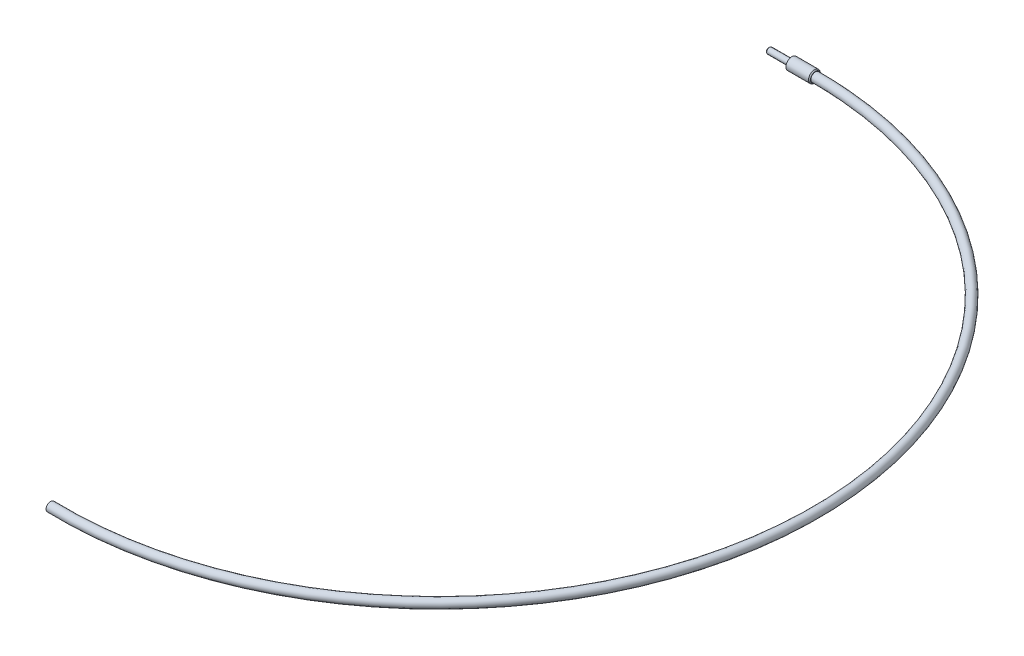
ISO-10303-21;
HEADER;
FILE_DESCRIPTION(('STEP AP214'),'2;1');
FILE_NAME('part.step','',(''),(''),'','','');
FILE_SCHEMA(('AUTOMOTIVE_DESIGN { 1 0 10303 214 1 1 1 1 }'));
ENDSEC;
DATA;
#1=APPLICATION_CONTEXT('core data for automotive mechanical design processes');
#2=APPLICATION_PROTOCOL_DEFINITION('international standard','automotive_design',2000,#1);
#3=PRODUCT_CONTEXT('',#1,'mechanical');
#4=PRODUCT('Part','Part','',(#3));
#5=PRODUCT_RELATED_PRODUCT_CATEGORY('part','',(#4));
#6=PRODUCT_DEFINITION_FORMATION('','',#4);
#7=PRODUCT_DEFINITION_CONTEXT('part definition',#1,'design');
#8=PRODUCT_DEFINITION('design','',#6,#7);
#9=PRODUCT_DEFINITION_SHAPE('','',#8);
#10=(LENGTH_UNIT() NAMED_UNIT(*) SI_UNIT(.MILLI.,.METRE.));
#11=(NAMED_UNIT(*) PLANE_ANGLE_UNIT() SI_UNIT($,.RADIAN.));
#12=(NAMED_UNIT(*) SI_UNIT($,.STERADIAN.) SOLID_ANGLE_UNIT());
#13=UNCERTAINTY_MEASURE_WITH_UNIT(LENGTH_MEASURE(1.E-05),#10,'distance_accuracy_value','');
#14=(GEOMETRIC_REPRESENTATION_CONTEXT(3) GLOBAL_UNCERTAINTY_ASSIGNED_CONTEXT((#13)) GLOBAL_UNIT_ASSIGNED_CONTEXT((#10,
#11,#12)) REPRESENTATION_CONTEXT('',''));
#15=CARTESIAN_POINT('',(0.,0.,0.));
#16=DIRECTION('',(0.,0.,1.));
#17=DIRECTION('',(1.,0.,0.));
#18=AXIS2_PLACEMENT_3D('',#15,#16,#17);
#19=CARTESIAN_POINT('',(-5.6128711497862,0.,203.122464728685));
#20=DIRECTION('',(-0.999618428782899,0.,-0.0276223973906801));
#21=DIRECTION('',(-0.0276223973906801,0.,0.999618428782899));
#22=AXIS2_PLACEMENT_3D('',#19,#20,#21);
#23=PLANE('',#22);
#24=CARTESIAN_POINT('',(-5.6128711497862,0.,203.122464728685));
#25=DIRECTION('',(-0.999618428782899,0.,-0.0276223973906801));
#26=DIRECTION('',(-0.0276223973906801,0.,0.999618428782899));
#27=AXIS2_PLACEMENT_3D('',#24,#25,#26);
#28=CIRCLE('',#27,2.413);
#29=CARTESIAN_POINT('',(-5.67952399468991,0.,205.534543997338));
#30=VERTEX_POINT('',#29);
#31=EDGE_CURVE('E46',#30,#30,#28,.T.);
#32=ORIENTED_EDGE('',*,*,#31,.T.);
#33=EDGE_LOOP('',(#32));
#34=FACE_BOUND('',#33,.T.);
#35=ADVANCED_FACE('F35',(#34),#23,.T.);
#36=CARTESIAN_POINT('',(0.,0.,0.));
#37=DIRECTION('',(0.,1.,0.));
#38=DIRECTION('',(0.,0.,1.));
#39=AXIS2_PLACEMENT_3D('',#36,#37,#38);
#40=TOROIDAL_SURFACE('',#39,203.2,2.413);
#41=CARTESIAN_POINT('',(0.,0.,-203.2));
#42=DIRECTION('',(1.,0.,0.));
#43=DIRECTION('',(0.,0.,-1.));
#44=AXIS2_PLACEMENT_3D('',#41,#42,#43);
#45=CIRCLE('',#44,2.413);
#46=CARTESIAN_POINT('',(0.,0.,-205.613));
#47=VERTEX_POINT('',#46);
#48=EDGE_CURVE('E50',#47,#47,#45,.T.);
#49=ORIENTED_EDGE('',*,*,#48,.T.);
#50=EDGE_LOOP('',(#49));
#51=FACE_BOUND('',#50,.T.);
#52=ORIENTED_EDGE('',*,*,#31,.F.);
#53=EDGE_LOOP('',(#52));
#54=FACE_BOUND('',#53,.T.);
#55=ADVANCED_FACE('F47',(#51,#54),#40,.T.);
#56=CARTESIAN_POINT('',(-12.7,0.,-203.2));
#57=DIRECTION('',(1.,0.,0.));
#58=DIRECTION('',(0.,0.,-1.));
#59=AXIS2_PLACEMENT_3D('',#56,#57,#58);
#60=CYLINDRICAL_SURFACE('',#59,3.17499999999997);
#61=CARTESIAN_POINT('',(-0.50800000000004,0.,-203.2));
#62=DIRECTION('',(1.,0.,0.));
#63=DIRECTION('',(0.,0.,-1.));
#64=AXIS2_PLACEMENT_3D('',#61,#62,#63);
#65=CIRCLE('',#64,3.17499999999997);
#66=CARTESIAN_POINT('',(-0.50800000000004,0.,-206.375));
#67=VERTEX_POINT('',#66);
#68=EDGE_CURVE('E53',#67,#67,#65,.F.);
#69=ORIENTED_EDGE('',*,*,#68,.T.);
#70=EDGE_LOOP('',(#69));
#71=FACE_BOUND('',#70,.T.);
#72=CARTESIAN_POINT('',(-12.7,0.,-203.2));
#73=DIRECTION('',(1.,0.,0.));
#74=DIRECTION('',(0.,0.,-1.));
#75=AXIS2_PLACEMENT_3D('',#72,#73,#74);
#76=CIRCLE('',#75,3.17499999999997);
#77=CARTESIAN_POINT('',(-12.7,0.,-206.375));
#78=VERTEX_POINT('',#77);
#79=EDGE_CURVE('E56',#78,#78,#76,.T.);
#80=ORIENTED_EDGE('',*,*,#79,.T.);
#81=EDGE_LOOP('',(#80));
#82=FACE_BOUND('',#81,.T.);
#83=ADVANCED_FACE('F72',(#71,#82),#60,.T.);
#84=CARTESIAN_POINT('',(-12.7,0.,-203.2));
#85=DIRECTION('',(1.,0.,0.));
#86=DIRECTION('',(0.,0.,-1.));
#87=AXIS2_PLACEMENT_3D('',#84,#85,#86);
#88=PLANE('',#87);
#89=CARTESIAN_POINT('',(-12.7,0.,-203.2));
#90=DIRECTION('',(-1.,0.,0.));
#91=DIRECTION('',(0.,0.,1.));
#92=AXIS2_PLACEMENT_3D('',#89,#90,#91);
#93=CIRCLE('',#92,1.58750000000004);
#94=CARTESIAN_POINT('',(-12.7,0.,-201.6125));
#95=VERTEX_POINT('',#94);
#96=EDGE_CURVE('E61',#95,#95,#93,.T.);
#97=ORIENTED_EDGE('',*,*,#96,.F.);
#98=EDGE_LOOP('',(#97));
#99=FACE_BOUND('',#98,.T.);
#100=ORIENTED_EDGE('',*,*,#79,.F.);
#101=EDGE_LOOP('',(#100));
#102=FACE_BOUND('',#101,.T.);
#103=ADVANCED_FACE('F74',(#99,#102),#88,.F.);
#104=CARTESIAN_POINT('',(0.,0.,-203.2));
#105=DIRECTION('',(1.,0.,0.));
#106=DIRECTION('',(0.,0.,-1.));
#107=AXIS2_PLACEMENT_3D('',#104,#105,#106);
#108=PLANE('',#107);
#109=CARTESIAN_POINT('',(0.,0.,-203.2));
#110=DIRECTION('',(1.,0.,0.));
#111=DIRECTION('',(0.,0.,-1.));
#112=AXIS2_PLACEMENT_3D('',#109,#110,#111);
#113=CIRCLE('',#112,2.66699999999992);
#114=CARTESIAN_POINT('',(0.,0.,-205.867));
#115=VERTEX_POINT('',#114);
#116=EDGE_CURVE('E49',#115,#115,#113,.T.);
#117=ORIENTED_EDGE('',*,*,#116,.T.);
#118=EDGE_LOOP('',(#117));
#119=FACE_BOUND('',#118,.T.);
#120=ORIENTED_EDGE('',*,*,#48,.F.);
#121=EDGE_LOOP('',(#120));
#122=FACE_BOUND('',#121,.T.);
#123=ADVANCED_FACE('F76',(#119,#122),#108,.T.);
#124=CARTESIAN_POINT('',(0.,0.,-203.2));
#125=DIRECTION('',(-1.,0.,0.));
#126=DIRECTION('',(0.,0.,1.));
#127=AXIS2_PLACEMENT_3D('',#124,#125,#126);
#128=CONICAL_SURFACE('',#127,2.66699999999992,0.785398163397459);
#129=ORIENTED_EDGE('',*,*,#68,.F.);
#130=EDGE_LOOP('',(#129));
#131=FACE_BOUND('',#130,.T.);
#132=ORIENTED_EDGE('',*,*,#116,.F.);
#133=EDGE_LOOP('',(#132));
#134=FACE_BOUND('',#133,.T.);
#135=ADVANCED_FACE('F83',(#131,#134),#128,.T.);
#136=CARTESIAN_POINT('',(-25.4,0.,-203.2));
#137=DIRECTION('',(1.,0.,0.));
#138=DIRECTION('',(0.,0.,-1.));
#139=AXIS2_PLACEMENT_3D('',#136,#137,#138);
#140=CYLINDRICAL_SURFACE('',#139,1.58750000000004);
#141=CARTESIAN_POINT('',(-24.6888000000001,0.,-203.2));
#142=DIRECTION('',(-1.,0.,0.));
#143=DIRECTION('',(0.,0.,1.));
#144=AXIS2_PLACEMENT_3D('',#141,#142,#143);
#145=CIRCLE('',#144,1.58750000000004);
#146=CARTESIAN_POINT('',(-24.6888000000001,0.,-201.6125));
#147=VERTEX_POINT('',#146);
#148=EDGE_CURVE('E11',#147,#147,#145,.F.);
#149=ORIENTED_EDGE('',*,*,#148,.T.);
#150=EDGE_LOOP('',(#149));
#151=FACE_BOUND('',#150,.T.);
#152=ORIENTED_EDGE('',*,*,#96,.T.);
#153=EDGE_LOOP('',(#152));
#154=FACE_BOUND('',#153,.T.);
#155=ADVANCED_FACE('F97',(#151,#154),#140,.T.);
#156=CARTESIAN_POINT('',(-25.4,0.,-203.2));
#157=DIRECTION('',(-1.,0.,0.));
#158=DIRECTION('',(0.,0.,1.));
#159=AXIS2_PLACEMENT_3D('',#156,#157,#158);
#160=PLANE('',#159);
#161=CARTESIAN_POINT('',(-25.4,0.,-203.2));
#162=DIRECTION('',(-1.,0.,0.));
#163=DIRECTION('',(0.,0.,1.));
#164=AXIS2_PLACEMENT_3D('',#161,#162,#163);
#165=CIRCLE('',#164,0.876300000000163);
#166=CARTESIAN_POINT('',(-25.4,0.,-202.3237));
#167=VERTEX_POINT('',#166);
#168=EDGE_CURVE('E42',#167,#167,#165,.T.);
#169=ORIENTED_EDGE('',*,*,#168,.T.);
#170=EDGE_LOOP('',(#169));
#171=FACE_BOUND('',#170,.T.);
#172=ADVANCED_FACE('F102',(#171),#160,.T.);
#173=CARTESIAN_POINT('',(-25.4,0.,-203.2));
#174=DIRECTION('',(1.,0.,0.));
#175=DIRECTION('',(0.,0.,-1.));
#176=AXIS2_PLACEMENT_3D('',#173,#174,#175);
#177=CONICAL_SURFACE('',#176,0.876300000000163,0.785398163397452);
#178=ORIENTED_EDGE('',*,*,#148,.F.);
#179=EDGE_LOOP('',(#178));
#180=FACE_BOUND('',#179,.T.);
#181=ORIENTED_EDGE('',*,*,#168,.F.);
#182=EDGE_LOOP('',(#181));
#183=FACE_BOUND('',#182,.T.);
#184=ADVANCED_FACE('F37',(#180,#183),#177,.T.);
#185=CLOSED_SHELL('',(#35,#55,#83,#103,#123,#135,#155,#172,#184));
#186=MANIFOLD_SOLID_BREP('B2',#185);
#187=ADVANCED_BREP_SHAPE_REPRESENTATION('',(#18,#186),#14);
#188=SHAPE_DEFINITION_REPRESENTATION(#9,#187);
ENDSEC;
END-ISO-10303-21;
